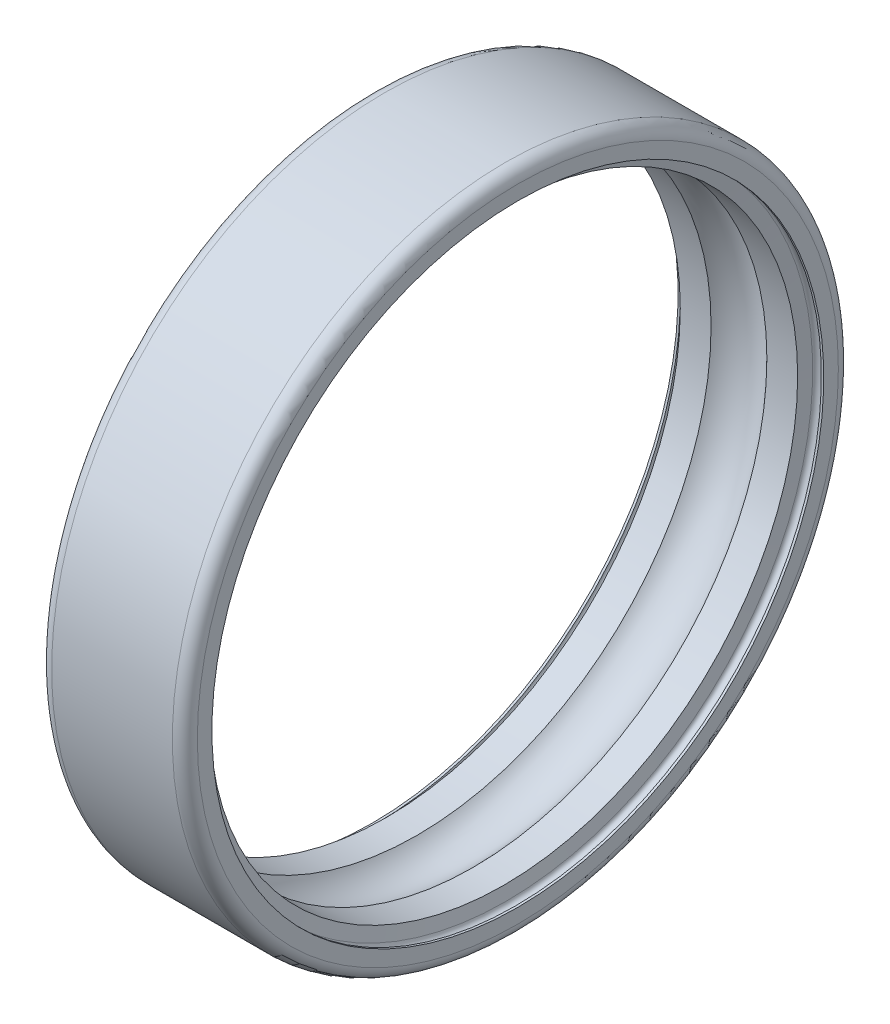
ISO-10303-21;
HEADER;
FILE_DESCRIPTION(('STEP AP214'),'2;1');
FILE_NAME('part.step','',(''),(''),'','','');
FILE_SCHEMA(('AUTOMOTIVE_DESIGN { 1 0 10303 214 1 1 1 1 }'));
ENDSEC;
DATA;
#1=APPLICATION_CONTEXT('core data for automotive mechanical design processes');
#2=APPLICATION_PROTOCOL_DEFINITION('international standard','automotive_design',2000,#1);
#3=PRODUCT_CONTEXT('',#1,'mechanical');
#4=PRODUCT('Part','Part','',(#3));
#5=PRODUCT_RELATED_PRODUCT_CATEGORY('part','',(#4));
#6=PRODUCT_DEFINITION_FORMATION('','',#4);
#7=PRODUCT_DEFINITION_CONTEXT('part definition',#1,'design');
#8=PRODUCT_DEFINITION('design','',#6,#7);
#9=PRODUCT_DEFINITION_SHAPE('','',#8);
#10=(LENGTH_UNIT() NAMED_UNIT(*) SI_UNIT(.MILLI.,.METRE.));
#11=(NAMED_UNIT(*) PLANE_ANGLE_UNIT() SI_UNIT($,.RADIAN.));
#12=(NAMED_UNIT(*) SI_UNIT($,.STERADIAN.) SOLID_ANGLE_UNIT());
#13=UNCERTAINTY_MEASURE_WITH_UNIT(LENGTH_MEASURE(1.E-05),#10,'distance_accuracy_value','');
#14=(GEOMETRIC_REPRESENTATION_CONTEXT(3) GLOBAL_UNCERTAINTY_ASSIGNED_CONTEXT((#13)) GLOBAL_UNIT_ASSIGNED_CONTEXT((#10,
#11,#12)) REPRESENTATION_CONTEXT('',''));
#15=CARTESIAN_POINT('',(0.,0.,0.));
#16=DIRECTION('',(0.,0.,1.));
#17=DIRECTION('',(1.,0.,0.));
#18=AXIS2_PLACEMENT_3D('',#15,#16,#17);
#19=CARTESIAN_POINT('',(6.655,0.,0.));
#20=DIRECTION('',(1.,0.,0.));
#21=DIRECTION('',(0.,0.,-1.));
#22=AXIS2_PLACEMENT_3D('',#19,#20,#21);
#23=TOROIDAL_SURFACE('',#22,14.7,0.23);
#24=CARTESIAN_POINT('',(6.885,0.,0.));
#25=DIRECTION('',(1.,0.,0.));
#26=DIRECTION('',(0.,1.,0.));
#27=AXIS2_PLACEMENT_3D('',#24,#25,#26);
#28=CIRCLE('',#27,14.7);
#29=CARTESIAN_POINT('',(6.885,14.7,0.));
#30=VERTEX_POINT('',#29);
#31=EDGE_CURVE('E11',#30,#30,#28,.T.);
#32=ORIENTED_EDGE('',*,*,#31,.T.);
#33=EDGE_LOOP('',(#32));
#34=FACE_BOUND('',#33,.T.);
#35=CARTESIAN_POINT('',(6.42849421680719,0.,0.));
#36=DIRECTION('',(1.,0.,0.));
#37=DIRECTION('',(0.,1.,0.));
#38=AXIS2_PLACEMENT_3D('',#35,#36,#37);
#39=CIRCLE('',#38,14.7399390808634);
#40=CARTESIAN_POINT('',(6.42849421680719,14.7399390808634,0.));
#41=VERTEX_POINT('',#40);
#42=EDGE_CURVE('E83',#41,#41,#39,.T.);
#43=ORIENTED_EDGE('',*,*,#42,.F.);
#44=EDGE_LOOP('',(#43));
#45=FACE_BOUND('',#44,.T.);
#46=ADVANCED_FACE('F16',(#34,#45),#23,.F.);
#47=CARTESIAN_POINT('',(6.9425,0.,0.));
#48=DIRECTION('',(-1.,0.,0.));
#49=DIRECTION('',(0.,1.,0.));
#50=AXIS2_PLACEMENT_3D('',#47,#48,#49);
#51=CYLINDRICAL_SURFACE('',#50,14.7);
#52=CARTESIAN_POINT('',(7.,0.,0.));
#53=DIRECTION('',(1.,0.,0.));
#54=DIRECTION('',(0.,1.,0.));
#55=AXIS2_PLACEMENT_3D('',#52,#53,#54);
#56=CIRCLE('',#55,14.7);
#57=CARTESIAN_POINT('',(7.,14.7,0.));
#58=VERTEX_POINT('',#57);
#59=EDGE_CURVE('E26',#58,#58,#56,.T.);
#60=ORIENTED_EDGE('',*,*,#59,.T.);
#61=EDGE_LOOP('',(#60));
#62=FACE_BOUND('',#61,.T.);
#63=ORIENTED_EDGE('',*,*,#31,.F.);
#64=EDGE_LOOP('',(#63));
#65=FACE_BOUND('',#64,.T.);
#66=ADVANCED_FACE('F118',(#62,#65),#51,.F.);
#67=CARTESIAN_POINT('',(7.,15.05,0.));
#68=DIRECTION('',(1.,0.,0.));
#69=DIRECTION('',(0.,1.,0.));
#70=AXIS2_PLACEMENT_3D('',#67,#68,#69);
#71=PLANE('',#70);
#72=CARTESIAN_POINT('',(7.,0.,0.));
#73=DIRECTION('',(1.,0.,0.));
#74=DIRECTION('',(0.,1.,0.));
#75=AXIS2_PLACEMENT_3D('',#72,#73,#74);
#76=CIRCLE('',#75,15.4);
#77=CARTESIAN_POINT('',(7.,15.4,0.));
#78=VERTEX_POINT('',#77);
#79=EDGE_CURVE('E91',#78,#78,#76,.T.);
#80=ORIENTED_EDGE('',*,*,#79,.T.);
#81=EDGE_LOOP('',(#80));
#82=FACE_BOUND('',#81,.T.);
#83=ORIENTED_EDGE('',*,*,#59,.F.);
#84=EDGE_LOOP('',(#83));
#85=FACE_BOUND('',#84,.T.);
#86=ADVANCED_FACE('F114',(#82,#85),#71,.T.);
#87=CARTESIAN_POINT('',(6.4,0.,0.));
#88=DIRECTION('',(1.,0.,0.));
#89=DIRECTION('',(0.,0.,-1.));
#90=AXIS2_PLACEMENT_3D('',#87,#88,#89);
#91=TOROIDAL_SURFACE('',#90,15.4,0.6);
#92=CARTESIAN_POINT('',(6.4,0.,0.));
#93=DIRECTION('',(1.,0.,0.));
#94=DIRECTION('',(0.,1.,0.));
#95=AXIS2_PLACEMENT_3D('',#92,#93,#94);
#96=CIRCLE('',#95,16.);
#97=CARTESIAN_POINT('',(6.4,16.,0.));
#98=VERTEX_POINT('',#97);
#99=EDGE_CURVE('E93',#98,#98,#96,.T.);
#100=ORIENTED_EDGE('',*,*,#99,.T.);
#101=EDGE_LOOP('',(#100));
#102=FACE_BOUND('',#101,.T.);
#103=ORIENTED_EDGE('',*,*,#79,.F.);
#104=EDGE_LOOP('',(#103));
#105=FACE_BOUND('',#104,.T.);
#106=ADVANCED_FACE('F18',(#102,#105),#91,.T.);
#107=CARTESIAN_POINT('',(3.5,0.,0.));
#108=DIRECTION('',(-1.,0.,0.));
#109=DIRECTION('',(0.,1.,0.));
#110=AXIS2_PLACEMENT_3D('',#107,#108,#109);
#111=CYLINDRICAL_SURFACE('',#110,16.);
#112=CARTESIAN_POINT('',(0.6,0.,0.));
#113=DIRECTION('',(1.,0.,0.));
#114=DIRECTION('',(0.,1.,0.));
#115=AXIS2_PLACEMENT_3D('',#112,#113,#114);
#116=CIRCLE('',#115,16.);
#117=CARTESIAN_POINT('',(0.6,16.,0.));
#118=VERTEX_POINT('',#117);
#119=EDGE_CURVE('E95',#118,#118,#116,.T.);
#120=ORIENTED_EDGE('',*,*,#119,.T.);
#121=EDGE_LOOP('',(#120));
#122=FACE_BOUND('',#121,.T.);
#123=ORIENTED_EDGE('',*,*,#99,.F.);
#124=EDGE_LOOP('',(#123));
#125=FACE_BOUND('',#124,.T.);
#126=ADVANCED_FACE('F102',(#122,#125),#111,.T.);
#127=CARTESIAN_POINT('',(0.6,0.,0.));
#128=DIRECTION('',(1.,0.,0.));
#129=DIRECTION('',(0.,0.,-1.));
#130=AXIS2_PLACEMENT_3D('',#127,#128,#129);
#131=TOROIDAL_SURFACE('',#130,15.4,0.6);
#132=CARTESIAN_POINT('',(0.,0.,0.));
#133=DIRECTION('',(1.,0.,0.));
#134=DIRECTION('',(0.,1.,0.));
#135=AXIS2_PLACEMENT_3D('',#132,#133,#134);
#136=CIRCLE('',#135,15.4);
#137=CARTESIAN_POINT('',(0.,15.4,0.));
#138=VERTEX_POINT('',#137);
#139=EDGE_CURVE('E74',#138,#138,#136,.T.);
#140=ORIENTED_EDGE('',*,*,#139,.T.);
#141=EDGE_LOOP('',(#140));
#142=FACE_BOUND('',#141,.T.);
#143=ORIENTED_EDGE('',*,*,#119,.F.);
#144=EDGE_LOOP('',(#143));
#145=FACE_BOUND('',#144,.T.);
#146=ADVANCED_FACE('F104',(#142,#145),#131,.T.);
#147=CARTESIAN_POINT('',(0.,15.05,0.));
#148=DIRECTION('',(-1.,0.,0.));
#149=DIRECTION('',(0.,-1.,0.));
#150=AXIS2_PLACEMENT_3D('',#147,#148,#149);
#151=PLANE('',#150);
#152=CARTESIAN_POINT('',(0.,0.,0.));
#153=DIRECTION('',(1.,0.,0.));
#154=DIRECTION('',(0.,1.,0.));
#155=AXIS2_PLACEMENT_3D('',#152,#153,#154);
#156=CIRCLE('',#155,14.7);
#157=CARTESIAN_POINT('',(0.,14.7,0.));
#158=VERTEX_POINT('',#157);
#159=EDGE_CURVE('E20',#158,#158,#156,.T.);
#160=ORIENTED_EDGE('',*,*,#159,.T.);
#161=EDGE_LOOP('',(#160));
#162=FACE_BOUND('',#161,.T.);
#163=ORIENTED_EDGE('',*,*,#139,.F.);
#164=EDGE_LOOP('',(#163));
#165=FACE_BOUND('',#164,.T.);
#166=ADVANCED_FACE('F112',(#162,#165),#151,.T.);
#167=CARTESIAN_POINT('',(0.0575,0.,0.));
#168=DIRECTION('',(-1.,0.,0.));
#169=DIRECTION('',(0.,1.,0.));
#170=AXIS2_PLACEMENT_3D('',#167,#168,#169);
#171=CYLINDRICAL_SURFACE('',#170,14.7);
#172=CARTESIAN_POINT('',(0.115,0.,0.));
#173=DIRECTION('',(1.,0.,0.));
#174=DIRECTION('',(0.,1.,0.));
#175=AXIS2_PLACEMENT_3D('',#172,#173,#174);
#176=CIRCLE('',#175,14.7);
#177=CARTESIAN_POINT('',(0.115,14.7,0.));
#178=VERTEX_POINT('',#177);
#179=EDGE_CURVE('E68',#178,#178,#176,.T.);
#180=ORIENTED_EDGE('',*,*,#179,.T.);
#181=EDGE_LOOP('',(#180));
#182=FACE_BOUND('',#181,.T.);
#183=ORIENTED_EDGE('',*,*,#159,.F.);
#184=EDGE_LOOP('',(#183));
#185=FACE_BOUND('',#184,.T.);
#186=ADVANCED_FACE('F69',(#182,#185),#171,.F.);
#187=CARTESIAN_POINT('',(0.345,0.,0.));
#188=DIRECTION('',(1.,0.,0.));
#189=DIRECTION('',(0.,0.,-1.));
#190=AXIS2_PLACEMENT_3D('',#187,#188,#189);
#191=TOROIDAL_SURFACE('',#190,14.7,0.23);
#192=CARTESIAN_POINT('',(0.571505783192808,0.,0.));
#193=DIRECTION('',(1.,0.,0.));
#194=DIRECTION('',(0.,1.,0.));
#195=AXIS2_PLACEMENT_3D('',#192,#193,#194);
#196=CIRCLE('',#195,14.7399390808634);
#197=CARTESIAN_POINT('',(0.571505783192807,14.7399390808634,0.));
#198=VERTEX_POINT('',#197);
#199=EDGE_CURVE('E72',#198,#198,#196,.T.);
#200=ORIENTED_EDGE('',*,*,#199,.T.);
#201=EDGE_LOOP('',(#200));
#202=FACE_BOUND('',#201,.T.);
#203=ORIENTED_EDGE('',*,*,#179,.F.);
#204=EDGE_LOOP('',(#203));
#205=FACE_BOUND('',#204,.T.);
#206=ADVANCED_FACE('F130',(#202,#205),#191,.F.);
#207=CARTESIAN_POINT('',(0.625720958916948,0.,0.));
#208=DIRECTION('',(-1.,0.,0.));
#209=DIRECTION('',(0.,1.,0.));
#210=AXIS2_PLACEMENT_3D('',#207,#208,#209);
#211=CONICAL_SURFACE('',#210,14.4324695404317,1.39626340159546);
#212=CARTESIAN_POINT('',(0.679936134641088,0.,0.));
#213=DIRECTION('',(1.,0.,0.));
#214=DIRECTION('',(0.,1.,0.));
#215=AXIS2_PLACEMENT_3D('',#212,#213,#214);
#216=CIRCLE('',#215,14.125);
#217=CARTESIAN_POINT('',(0.679936134641088,14.125,0.));
#218=VERTEX_POINT('',#217);
#219=EDGE_CURVE('E75',#218,#218,#216,.T.);
#220=ORIENTED_EDGE('',*,*,#219,.T.);
#221=EDGE_LOOP('',(#220));
#222=FACE_BOUND('',#221,.T.);
#223=ORIENTED_EDGE('',*,*,#199,.F.);
#224=EDGE_LOOP('',(#223));
#225=FACE_BOUND('',#224,.T.);
#226=ADVANCED_FACE('F143',(#222,#225),#211,.F.);
#227=CARTESIAN_POINT('',(1.41973023639782,0.,0.));
#228=DIRECTION('',(-1.,0.,0.));
#229=DIRECTION('',(0.,1.,0.));
#230=AXIS2_PLACEMENT_3D('',#227,#228,#229);
#231=CYLINDRICAL_SURFACE('',#230,14.125);
#232=CARTESIAN_POINT('',(2.15952433815455,0.,0.));
#233=DIRECTION('',(1.,0.,0.));
#234=DIRECTION('',(0.,1.,0.));
#235=AXIS2_PLACEMENT_3D('',#232,#233,#234);
#236=CIRCLE('',#235,14.125);
#237=CARTESIAN_POINT('',(2.15952433815455,14.125,0.));
#238=VERTEX_POINT('',#237);
#239=EDGE_CURVE('E79',#238,#238,#236,.T.);
#240=ORIENTED_EDGE('',*,*,#239,.T.);
#241=EDGE_LOOP('',(#240));
#242=FACE_BOUND('',#241,.T.);
#243=ORIENTED_EDGE('',*,*,#219,.F.);
#244=EDGE_LOOP('',(#243));
#245=FACE_BOUND('',#244,.T.);
#246=ADVANCED_FACE('F140',(#242,#245),#231,.F.);
#247=CARTESIAN_POINT('',(3.5,0.,0.));
#248=DIRECTION('',(1.,0.,0.));
#249=DIRECTION('',(0.,0.,-1.));
#250=AXIS2_PLACEMENT_3D('',#247,#248,#249);
#251=TOROIDAL_SURFACE('',#250,13.,1.75);
#252=CARTESIAN_POINT('',(4.84047566184545,0.,0.));
#253=DIRECTION('',(1.,0.,0.));
#254=DIRECTION('',(0.,1.,0.));
#255=AXIS2_PLACEMENT_3D('',#252,#253,#254);
#256=CIRCLE('',#255,14.125);
#257=CARTESIAN_POINT('',(4.84047566184545,14.125,0.));
#258=VERTEX_POINT('',#257);
#259=EDGE_CURVE('E80',#258,#258,#256,.T.);
#260=ORIENTED_EDGE('',*,*,#259,.T.);
#261=EDGE_LOOP('',(#260));
#262=FACE_BOUND('',#261,.T.);
#263=ORIENTED_EDGE('',*,*,#239,.F.);
#264=EDGE_LOOP('',(#263));
#265=FACE_BOUND('',#264,.T.);
#266=ADVANCED_FACE('F135',(#262,#265),#251,.F.);
#267=CARTESIAN_POINT('',(5.58026976360218,0.,0.));
#268=DIRECTION('',(-1.,0.,0.));
#269=DIRECTION('',(0.,1.,0.));
#270=AXIS2_PLACEMENT_3D('',#267,#268,#269);
#271=CYLINDRICAL_SURFACE('',#270,14.125);
#272=CARTESIAN_POINT('',(6.32006386535891,0.,0.));
#273=DIRECTION('',(1.,0.,0.));
#274=DIRECTION('',(0.,1.,0.));
#275=AXIS2_PLACEMENT_3D('',#272,#273,#274);
#276=CIRCLE('',#275,14.125);
#277=CARTESIAN_POINT('',(6.32006386535891,14.125,0.));
#278=VERTEX_POINT('',#277);
#279=EDGE_CURVE('E87',#278,#278,#276,.T.);
#280=ORIENTED_EDGE('',*,*,#279,.T.);
#281=EDGE_LOOP('',(#280));
#282=FACE_BOUND('',#281,.T.);
#283=ORIENTED_EDGE('',*,*,#259,.F.);
#284=EDGE_LOOP('',(#283));
#285=FACE_BOUND('',#284,.T.);
#286=ADVANCED_FACE('F131',(#282,#285),#271,.F.);
#287=CARTESIAN_POINT('',(6.37427904108305,0.,0.));
#288=DIRECTION('',(1.,0.,0.));
#289=DIRECTION('',(0.,1.,0.));
#290=AXIS2_PLACEMENT_3D('',#287,#288,#289);
#291=CONICAL_SURFACE('',#290,14.4324695404317,1.39626340159546);
#292=ORIENTED_EDGE('',*,*,#42,.T.);
#293=EDGE_LOOP('',(#292));
#294=FACE_BOUND('',#293,.T.);
#295=ORIENTED_EDGE('',*,*,#279,.F.);
#296=EDGE_LOOP('',(#295));
#297=FACE_BOUND('',#296,.T.);
#298=ADVANCED_FACE('F134',(#294,#297),#291,.F.);
#299=CLOSED_SHELL('',(#46,#66,#86,#106,#126,#146,#166,#186,#206,#226,#246,#266,#286,#298));
#300=MANIFOLD_SOLID_BREP('B1',#299);
#301=ADVANCED_BREP_SHAPE_REPRESENTATION('',(#18,#300),#14);
#302=SHAPE_DEFINITION_REPRESENTATION(#9,#301);
ENDSEC;
END-ISO-10303-21;
